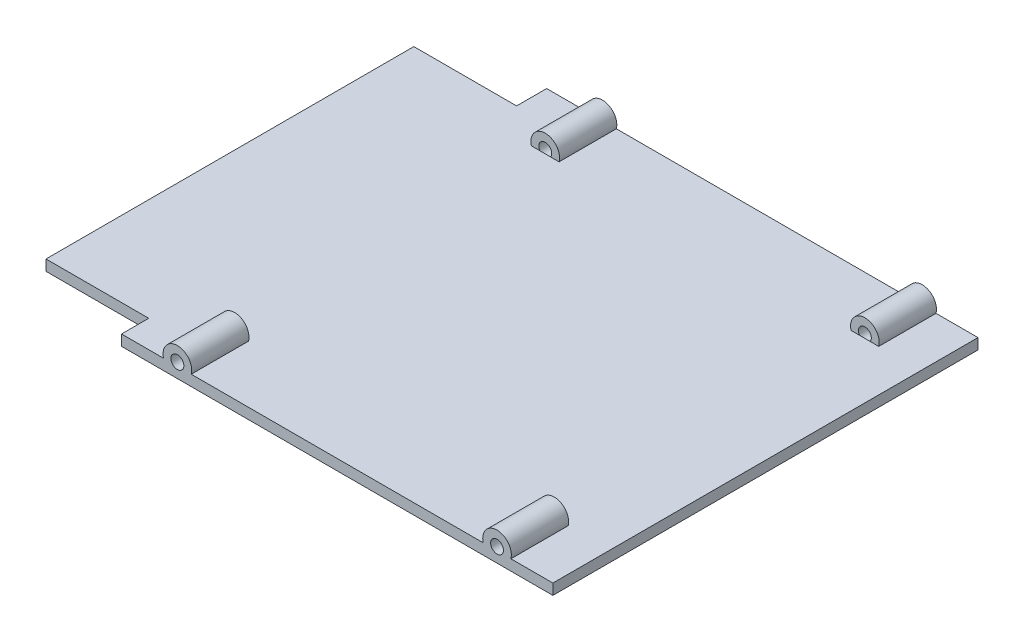
ISO-10303-21;
HEADER;
FILE_DESCRIPTION(('STEP AP214'),'2;1');
FILE_NAME('part.step','',(''),(''),'','','');
FILE_SCHEMA(('AUTOMOTIVE_DESIGN { 1 0 10303 214 1 1 1 1 }'));
ENDSEC;
DATA;
#1=APPLICATION_CONTEXT('core data for automotive mechanical design processes');
#2=APPLICATION_PROTOCOL_DEFINITION('international standard','automotive_design',2000,#1);
#3=PRODUCT_CONTEXT('',#1,'mechanical');
#4=PRODUCT('Part','Part','',(#3));
#5=PRODUCT_RELATED_PRODUCT_CATEGORY('part','',(#4));
#6=PRODUCT_DEFINITION_FORMATION('','',#4);
#7=PRODUCT_DEFINITION_CONTEXT('part definition',#1,'design');
#8=PRODUCT_DEFINITION('design','',#6,#7);
#9=PRODUCT_DEFINITION_SHAPE('','',#8);
#10=(LENGTH_UNIT() NAMED_UNIT(*) SI_UNIT(.MILLI.,.METRE.));
#11=(NAMED_UNIT(*) PLANE_ANGLE_UNIT() SI_UNIT($,.RADIAN.));
#12=(NAMED_UNIT(*) SI_UNIT($,.STERADIAN.) SOLID_ANGLE_UNIT());
#13=UNCERTAINTY_MEASURE_WITH_UNIT(LENGTH_MEASURE(1.E-05),#10,'distance_accuracy_value','');
#14=(GEOMETRIC_REPRESENTATION_CONTEXT(3) GLOBAL_UNCERTAINTY_ASSIGNED_CONTEXT((#13)) GLOBAL_UNIT_ASSIGNED_CONTEXT((#10,
#11,#12)) REPRESENTATION_CONTEXT('',''));
#15=CARTESIAN_POINT('',(0.,0.,0.));
#16=DIRECTION('',(0.,0.,1.));
#17=DIRECTION('',(1.,0.,0.));
#18=AXIS2_PLACEMENT_3D('',#15,#16,#17);
#19=CARTESIAN_POINT('',(-567.144993097305,-6.26719487480586,-74.8561140107656));
#20=DIRECTION('',(-1.,0.,0.));
#21=DIRECTION('',(0.,0.,1.));
#22=AXIS2_PLACEMENT_3D('',#19,#20,#21);
#23=PLANE('',#22);
#24=DIRECTION('',(0.,1.,0.));
#25=VECTOR('',#24,1.);
#26=CARTESIAN_POINT('',(-567.144993097307,-26.2671948748163,40.9925552959329));
#27=LINE('',#26,#25);
#28=CARTESIAN_POINT('',(-567.144993097305,-26.2671948748163,40.9925552959329));
#29=VERTEX_POINT('',#28);
#30=CARTESIAN_POINT('',(-567.144993097305,-24.7671948748163,40.9925552959329));
#31=VERTEX_POINT('',#30);
#32=EDGE_CURVE('E255',#29,#31,#27,.T.);
#33=ORIENTED_EDGE('',*,*,#32,.F.);
#34=DIRECTION('',(0.,0.,1.));
#35=VECTOR('',#34,1.);
#36=CARTESIAN_POINT('',(-567.144993097305,-26.2671948748163,-74.8561140107656));
#37=LINE('',#36,#35);
#38=CARTESIAN_POINT('',(-567.144993097305,-26.2671948748163,44.7925552959319));
#39=VERTEX_POINT('',#38);
#40=EDGE_CURVE('E308',#29,#39,#37,.T.);
#41=ORIENTED_EDGE('',*,*,#40,.T.);
#42=DIRECTION('',(0.,-1.,0.));
#43=VECTOR('',#42,1.);
#44=CARTESIAN_POINT('',(-567.144993097305,-6.26719487480586,44.7925552959319));
#45=LINE('',#44,#43);
#46=CARTESIAN_POINT('',(-567.144993097305,-24.7671948748163,44.7925552959319));
#47=VERTEX_POINT('',#46);
#48=EDGE_CURVE('E285',#47,#39,#45,.T.);
#49=ORIENTED_EDGE('',*,*,#48,.F.);
#50=DIRECTION('',(0.,0.,1.));
#51=VECTOR('',#50,1.);
#52=CARTESIAN_POINT('',(-567.144993097305,-24.7671948748163,-74.8561140107656));
#53=LINE('',#52,#51);
#54=EDGE_CURVE('E312',#31,#47,#53,.T.);
#55=ORIENTED_EDGE('',*,*,#54,.F.);
#56=EDGE_LOOP('',(#33,#41,#49,#55));
#57=FACE_BOUND('',#56,.T.);
#58=ADVANCED_FACE('F40',(#57),#23,.T.);
#59=CARTESIAN_POINT('',(-391.344993097289,-6.26719487480598,-14.5874447040671));
#60=DIRECTION('',(0.,0.,-1.));
#61=DIRECTION('',(-1.,0.,0.));
#62=AXIS2_PLACEMENT_3D('',#59,#60,#61);
#63=PLANE('',#62);
#64=CARTESIAN_POINT('',(-559.344993097226,-24.2671948748052,-14.5874447040671));
#65=DIRECTION('',(0.,0.,-1.));
#66=DIRECTION('',(0.,1.,0.));
#67=AXIS2_PLACEMENT_3D('',#64,#65,#66);
#68=CIRCLE('',#67,0.900000000010855);
#69=CARTESIAN_POINT('',(-559.344993097226,-23.3671948747944,-14.5874447040671));
#70=VERTEX_POINT('',#69);
#71=EDGE_CURVE('E213',#70,#70,#68,.T.);
#72=ORIENTED_EDGE('',*,*,#71,.F.);
#73=EDGE_LOOP('',(#72));
#74=FACE_BOUND('',#73,.T.);
#75=CARTESIAN_POINT('',(-514.694993097289,-24.2671948748052,-14.5874447040671));
#76=DIRECTION('',(0.,0.,-1.));
#77=DIRECTION('',(0.,1.,0.));
#78=AXIS2_PLACEMENT_3D('',#75,#76,#77);
#79=CIRCLE('',#78,0.900000000010855);
#80=CARTESIAN_POINT('',(-514.694993097289,-23.3671948747943,-14.5874447040671));
#81=VERTEX_POINT('',#80);
#82=EDGE_CURVE('E216',#81,#81,#79,.T.);
#83=ORIENTED_EDGE('',*,*,#82,.F.);
#84=EDGE_LOOP('',(#83));
#85=FACE_BOUND('',#84,.T.);
#86=DIRECTION('',(-1.,0.,0.));
#87=VECTOR('',#86,1.);
#88=CARTESIAN_POINT('',(-391.34499309729,-24.7671948748163,-14.5874447040671));
#89=LINE('',#88,#87);
#90=CARTESIAN_POINT('',(-561.281484769779,-24.7671948748163,-14.5874447040671));
#91=VERTEX_POINT('',#90);
#92=CARTESIAN_POINT('',(-567.144993097305,-24.7671948748163,-14.5874447040671));
#93=VERTEX_POINT('',#92);
#94=EDGE_CURVE('E314',#91,#93,#89,.T.);
#95=ORIENTED_EDGE('',*,*,#94,.F.);
#96=CARTESIAN_POINT('',(-559.344993097226,-24.2671948748052,-14.5874447040671));
#97=DIRECTION('',(0.,0.,-1.));
#98=DIRECTION('',(0.,1.,0.));
#99=AXIS2_PLACEMENT_3D('',#96,#97,#98);
#100=CIRCLE('',#99,1.99999999946984);
#101=CARTESIAN_POINT('',(-557.408501424673,-24.7671948748163,-14.5874447040671));
#102=VERTEX_POINT('',#101);
#103=EDGE_CURVE('E225',#91,#102,#100,.T.);
#104=ORIENTED_EDGE('',*,*,#103,.T.);
#105=CARTESIAN_POINT('',(-516.631484771049,-24.7671948748163,-14.5874447040671));
#106=VERTEX_POINT('',#105);
#107=EDGE_CURVE('E313',#106,#102,#89,.T.);
#108=ORIENTED_EDGE('',*,*,#107,.F.);
#109=CARTESIAN_POINT('',(-514.694993097289,-24.2671948748052,-14.5874447040671));
#110=DIRECTION('',(0.,0.,-1.));
#111=DIRECTION('',(0.,1.,0.));
#112=AXIS2_PLACEMENT_3D('',#109,#110,#111);
#113=CIRCLE('',#112,2.00000000063811);
#114=CARTESIAN_POINT('',(-512.758501423529,-24.7671948748163,-14.5874447040671));
#115=VERTEX_POINT('',#114);
#116=EDGE_CURVE('E228',#106,#115,#113,.T.);
#117=ORIENTED_EDGE('',*,*,#116,.T.);
#118=CARTESIAN_POINT('',(-506.894993097303,-24.7671948748163,-14.5874447040671));
#119=VERTEX_POINT('',#118);
#120=EDGE_CURVE('E310',#119,#115,#89,.T.);
#121=ORIENTED_EDGE('',*,*,#120,.F.);
#122=DIRECTION('',(0.,1.,0.));
#123=VECTOR('',#122,1.);
#124=CARTESIAN_POINT('',(-506.894993097303,-6.26719487480586,-14.5874447040671));
#125=LINE('',#124,#123);
#126=CARTESIAN_POINT('',(-506.894993097303,-26.2671948748163,-14.5874447040671));
#127=VERTEX_POINT('',#126);
#128=EDGE_CURVE('E288',#127,#119,#125,.T.);
#129=ORIENTED_EDGE('',*,*,#128,.F.);
#130=DIRECTION('',(1.,0.,0.));
#131=VECTOR('',#130,1.);
#132=CARTESIAN_POINT('',(-391.34499309729,-26.2671948748163,-14.5874447040671));
#133=LINE('',#132,#131);
#134=CARTESIAN_POINT('',(-567.144993097305,-26.2671948748163,-14.5874447040671));
#135=VERTEX_POINT('',#134);
#136=EDGE_CURVE('E301',#135,#127,#133,.T.);
#137=ORIENTED_EDGE('',*,*,#136,.F.);
#138=DIRECTION('',(0.,-1.,0.));
#139=VECTOR('',#138,1.);
#140=CARTESIAN_POINT('',(-567.144993097305,-6.26719487480586,-14.5874447040671));
#141=LINE('',#140,#139);
#142=EDGE_CURVE('E305',#93,#135,#141,.T.);
#143=ORIENTED_EDGE('',*,*,#142,.F.);
#144=EDGE_LOOP('',(#95,#104,#108,#117,#121,#129,#137,#143));
#145=FACE_BOUND('',#144,.T.);
#146=ADVANCED_FACE('F42',(#74,#85,#145),#63,.T.);
#147=CARTESIAN_POINT('',(0.,0.,44.7925552959312));
#148=DIRECTION('',(0.,0.,1.));
#149=DIRECTION('',(1.,0.,0.));
#150=AXIS2_PLACEMENT_3D('',#147,#148,#149);
#151=PLANE('',#150);
#152=CARTESIAN_POINT('',(-514.694993097289,-24.2671948748052,44.7925552959312));
#153=DIRECTION('',(0.,0.,1.));
#154=DIRECTION('',(1.,0.,0.));
#155=AXIS2_PLACEMENT_3D('',#152,#153,#154);
#156=CIRCLE('',#155,0.899999999982432);
#157=CARTESIAN_POINT('',(-513.794993097306,-24.2671948748052,44.7925552959312));
#158=VERTEX_POINT('',#157);
#159=EDGE_CURVE('E396',#158,#158,#156,.T.);
#160=ORIENTED_EDGE('',*,*,#159,.F.);
#161=EDGE_LOOP('',(#160));
#162=FACE_BOUND('',#161,.T.);
#163=CARTESIAN_POINT('',(-559.344993097226,-24.2671948748052,44.7925552959312));
#164=DIRECTION('',(0.,0.,1.));
#165=DIRECTION('',(1.,0.,0.));
#166=AXIS2_PLACEMENT_3D('',#163,#164,#165);
#167=CIRCLE('',#166,0.899999999982697);
#168=CARTESIAN_POINT('',(-558.444993097243,-24.2671948748052,44.7925552959312));
#169=VERTEX_POINT('',#168);
#170=EDGE_CURVE('E185',#169,#169,#167,.T.);
#171=ORIENTED_EDGE('',*,*,#170,.F.);
#172=EDGE_LOOP('',(#171));
#173=FACE_BOUND('',#172,.T.);
#174=DIRECTION('',(-1.,0.,0.));
#175=VECTOR('',#174,1.);
#176=CARTESIAN_POINT('',(-391.34499309729,-24.7671948748163,44.7925552959316));
#177=LINE('',#176,#175);
#178=CARTESIAN_POINT('',(-506.894993097303,-24.7671948748163,44.7925552959318));
#179=VERTEX_POINT('',#178);
#180=CARTESIAN_POINT('',(-512.758501424418,-24.7671948748163,44.7925552959312));
#181=VERTEX_POINT('',#180);
#182=EDGE_CURVE('E289',#179,#181,#177,.T.);
#183=ORIENTED_EDGE('',*,*,#182,.T.);
#184=CARTESIAN_POINT('',(-514.694993097289,-24.2671948748052,44.7925552959312));
#185=DIRECTION('',(0.,0.,1.));
#186=DIRECTION('',(1.,0.,0.));
#187=AXIS2_PLACEMENT_3D('',#184,#185,#186);
#188=CIRCLE('',#187,1.99999999977756);
#189=CARTESIAN_POINT('',(-516.63148477016,-24.7671948748163,44.7925552959318));
#190=VERTEX_POINT('',#189);
#191=EDGE_CURVE('E368',#181,#190,#188,.T.);
#192=ORIENTED_EDGE('',*,*,#191,.T.);
#193=CARTESIAN_POINT('',(-557.408501424106,-24.7671948748163,44.7925552959312));
#194=VERTEX_POINT('',#193);
#195=EDGE_CURVE('E292',#190,#194,#177,.T.);
#196=ORIENTED_EDGE('',*,*,#195,.T.);
#197=CARTESIAN_POINT('',(-559.344993097226,-24.2671948748052,44.7925552959312));
#198=DIRECTION('',(0.,0.,1.));
#199=DIRECTION('',(1.,0.,0.));
#200=AXIS2_PLACEMENT_3D('',#197,#198,#199);
#201=CIRCLE('',#200,2.00000000001844);
#202=CARTESIAN_POINT('',(-561.281484770346,-24.7671948748163,44.7925552959318));
#203=VERTEX_POINT('',#202);
#204=EDGE_CURVE('E366',#194,#203,#201,.T.);
#205=ORIENTED_EDGE('',*,*,#204,.T.);
#206=EDGE_CURVE('E293',#203,#47,#177,.T.);
#207=ORIENTED_EDGE('',*,*,#206,.T.);
#208=ORIENTED_EDGE('',*,*,#48,.T.);
#209=DIRECTION('',(1.,0.,0.));
#210=VECTOR('',#209,1.);
#211=CARTESIAN_POINT('',(-391.34499309729,-26.2671948748163,44.7925552959316));
#212=LINE('',#211,#210);
#213=CARTESIAN_POINT('',(-506.894993097303,-26.2671948748163,44.7925552959318));
#214=VERTEX_POINT('',#213);
#215=EDGE_CURVE('E268',#39,#214,#212,.T.);
#216=ORIENTED_EDGE('',*,*,#215,.T.);
#217=DIRECTION('',(0.,1.,0.));
#218=VECTOR('',#217,1.);
#219=CARTESIAN_POINT('',(-506.894993097303,-6.26719487480586,44.7925552959318));
#220=LINE('',#219,#218);
#221=EDGE_CURVE('E294',#214,#179,#220,.T.);
#222=ORIENTED_EDGE('',*,*,#221,.T.);
#223=EDGE_LOOP('',(#183,#192,#196,#205,#207,#208,#216,#222));
#224=FACE_BOUND('',#223,.T.);
#225=ADVANCED_FACE('F364',(#162,#173,#224),#151,.T.);
#226=CARTESIAN_POINT('',(-506.894993097303,-6.26719487480586,-74.8561140107657));
#227=DIRECTION('',(1.,0.,0.));
#228=DIRECTION('',(0.,0.,-1.));
#229=AXIS2_PLACEMENT_3D('',#226,#227,#228);
#230=PLANE('',#229);
#231=DIRECTION('',(0.,0.,1.));
#232=VECTOR('',#231,1.);
#233=CARTESIAN_POINT('',(-506.894993097303,-26.2671948748163,-74.8561140107657));
#234=LINE('',#233,#232);
#235=EDGE_CURVE('E303',#127,#214,#234,.T.);
#236=ORIENTED_EDGE('',*,*,#235,.F.);
#237=ORIENTED_EDGE('',*,*,#128,.T.);
#238=DIRECTION('',(0.,0.,1.));
#239=VECTOR('',#238,1.);
#240=CARTESIAN_POINT('',(-506.894993097303,-24.7671948748163,-74.8561140107657));
#241=LINE('',#240,#239);
#242=EDGE_CURVE('E300',#119,#179,#241,.T.);
#243=ORIENTED_EDGE('',*,*,#242,.T.);
#244=ORIENTED_EDGE('',*,*,#221,.F.);
#245=EDGE_LOOP('',(#236,#237,#243,#244));
#246=FACE_BOUND('',#245,.T.);
#247=ADVANCED_FACE('F405',(#246),#230,.T.);
#248=CARTESIAN_POINT('',(-391.34499309729,-24.7671948748163,-74.8561140107658));
#249=DIRECTION('',(0.,1.,0.));
#250=DIRECTION('',(-1.,0.,0.));
#251=AXIS2_PLACEMENT_3D('',#248,#249,#250);
#252=PLANE('',#251);
#253=DIRECTION('',(0.,0.,1.));
#254=VECTOR('',#253,1.);
#255=CARTESIAN_POINT('',(-561.281484770346,-24.7671948748163,36.7925552959312));
#256=LINE('',#255,#254);
#257=CARTESIAN_POINT('',(-561.281484770346,-24.7671948748163,36.7925552959312));
#258=VERTEX_POINT('',#257);
#259=EDGE_CURVE('E205',#258,#203,#256,.T.);
#260=ORIENTED_EDGE('',*,*,#259,.F.);
#261=DIRECTION('',(1.,0.,0.));
#262=VECTOR('',#261,1.);
#263=CARTESIAN_POINT('',(-391.34499309729,-24.7671948748163,36.7925552959312));
#264=LINE('',#263,#262);
#265=CARTESIAN_POINT('',(-560.093324574553,-24.7671948748163,36.7925552959312));
#266=VERTEX_POINT('',#265);
#267=EDGE_CURVE('E197',#258,#266,#264,.T.);
#268=ORIENTED_EDGE('',*,*,#267,.T.);
#269=CARTESIAN_POINT('',(-558.5966616199,-24.7671948748163,36.7925552959312));
#270=VERTEX_POINT('',#269);
#271=EDGE_CURVE('E184',#266,#270,#264,.T.);
#272=ORIENTED_EDGE('',*,*,#271,.T.);
#273=CARTESIAN_POINT('',(-557.408501424106,-24.7671948748163,36.7925552959312));
#274=VERTEX_POINT('',#273);
#275=EDGE_CURVE('E188',#270,#274,#264,.T.);
#276=ORIENTED_EDGE('',*,*,#275,.T.);
#277=DIRECTION('',(0.,0.,1.));
#278=VECTOR('',#277,1.);
#279=CARTESIAN_POINT('',(-557.408501424106,-24.7671948748163,36.7925552959312));
#280=LINE('',#279,#278);
#281=EDGE_CURVE('E200',#194,#274,#280,.F.);
#282=ORIENTED_EDGE('',*,*,#281,.F.);
#283=ORIENTED_EDGE('',*,*,#195,.F.);
#284=DIRECTION('',(0.,0.,1.));
#285=VECTOR('',#284,1.);
#286=CARTESIAN_POINT('',(-516.63148477016,-24.7671948748163,36.7925552959312));
#287=LINE('',#286,#285);
#288=CARTESIAN_POINT('',(-516.63148477016,-24.7671948748163,36.7925552959312));
#289=VERTEX_POINT('',#288);
#290=EDGE_CURVE('E195',#289,#190,#287,.T.);
#291=ORIENTED_EDGE('',*,*,#290,.F.);
#292=DIRECTION('',(1.,0.,0.));
#293=VECTOR('',#292,1.);
#294=CARTESIAN_POINT('',(-391.34499309729,-24.7671948748163,36.7925552959312));
#295=LINE('',#294,#293);
#296=CARTESIAN_POINT('',(-515.443324574615,-24.7671948748163,36.7925552959312));
#297=VERTEX_POINT('',#296);
#298=EDGE_CURVE('E382',#289,#297,#295,.T.);
#299=ORIENTED_EDGE('',*,*,#298,.T.);
#300=CARTESIAN_POINT('',(-513.946661619963,-24.7671948748163,36.7925552959312));
#301=VERTEX_POINT('',#300);
#302=EDGE_CURVE('E384',#297,#301,#295,.T.);
#303=ORIENTED_EDGE('',*,*,#302,.T.);
#304=CARTESIAN_POINT('',(-512.758501424418,-24.7671948748163,36.7925552959312));
#305=VERTEX_POINT('',#304);
#306=EDGE_CURVE('E375',#301,#305,#295,.T.);
#307=ORIENTED_EDGE('',*,*,#306,.T.);
#308=DIRECTION('',(0.,0.,1.));
#309=VECTOR('',#308,1.);
#310=CARTESIAN_POINT('',(-512.758501424418,-24.7671948748163,36.7925552959312));
#311=LINE('',#310,#309);
#312=EDGE_CURVE('E383',#181,#305,#311,.F.);
#313=ORIENTED_EDGE('',*,*,#312,.F.);
#314=ORIENTED_EDGE('',*,*,#182,.F.);
#315=ORIENTED_EDGE('',*,*,#242,.F.);
#316=ORIENTED_EDGE('',*,*,#120,.T.);
#317=DIRECTION('',(0.,0.,-1.));
#318=VECTOR('',#317,1.);
#319=CARTESIAN_POINT('',(-512.758501423529,-24.7671948748163,-6.58744470406709));
#320=LINE('',#319,#318);
#321=CARTESIAN_POINT('',(-512.758501423529,-24.7671948748163,-6.58744470406709));
#322=VERTEX_POINT('',#321);
#323=EDGE_CURVE('E240',#322,#115,#320,.T.);
#324=ORIENTED_EDGE('',*,*,#323,.F.);
#325=DIRECTION('',(-1.,0.,0.));
#326=VECTOR('',#325,1.);
#327=CARTESIAN_POINT('',(-391.34499309729,-24.7671948748163,-6.58744470406708));
#328=LINE('',#327,#326);
#329=CARTESIAN_POINT('',(-513.946661619928,-24.7671948748163,-6.58744470406709));
#330=VERTEX_POINT('',#329);
#331=EDGE_CURVE('E233',#322,#330,#328,.T.);
#332=ORIENTED_EDGE('',*,*,#331,.T.);
#333=CARTESIAN_POINT('',(-515.443324574649,-24.7671948748163,-6.58744470406709));
#334=VERTEX_POINT('',#333);
#335=EDGE_CURVE('E237',#330,#334,#328,.T.);
#336=ORIENTED_EDGE('',*,*,#335,.T.);
#337=CARTESIAN_POINT('',(-516.631484771049,-24.7671948748163,-6.58744470406709));
#338=VERTEX_POINT('',#337);
#339=EDGE_CURVE('E224',#334,#338,#328,.T.);
#340=ORIENTED_EDGE('',*,*,#339,.T.);
#341=DIRECTION('',(0.,0.,-1.));
#342=VECTOR('',#341,1.);
#343=CARTESIAN_POINT('',(-516.631484771049,-24.7671948748163,-6.58744470406709));
#344=LINE('',#343,#342);
#345=EDGE_CURVE('E236',#106,#338,#344,.F.);
#346=ORIENTED_EDGE('',*,*,#345,.F.);
#347=ORIENTED_EDGE('',*,*,#107,.T.);
#348=DIRECTION('',(0.,0.,-1.));
#349=VECTOR('',#348,1.);
#350=CARTESIAN_POINT('',(-557.408501424673,-24.7671948748163,-6.58744470406709));
#351=LINE('',#350,#349);
#352=CARTESIAN_POINT('',(-557.408501424673,-24.7671948748163,-6.58744470406709));
#353=VERTEX_POINT('',#352);
#354=EDGE_CURVE('E251',#353,#102,#351,.T.);
#355=ORIENTED_EDGE('',*,*,#354,.F.);
#356=DIRECTION('',(-1.,0.,0.));
#357=VECTOR('',#356,1.);
#358=CARTESIAN_POINT('',(-391.34499309729,-24.7671948748163,-6.58744470406708));
#359=LINE('',#358,#357);
#360=CARTESIAN_POINT('',(-558.596661619866,-24.7671948748163,-6.58744470406709));
#361=VERTEX_POINT('',#360);
#362=EDGE_CURVE('E244',#353,#361,#359,.T.);
#363=ORIENTED_EDGE('',*,*,#362,.T.);
#364=CARTESIAN_POINT('',(-560.093324574587,-24.7671948748163,-6.58744470406709));
#365=VERTEX_POINT('',#364);
#366=EDGE_CURVE('E248',#361,#365,#359,.T.);
#367=ORIENTED_EDGE('',*,*,#366,.T.);
#368=CARTESIAN_POINT('',(-561.281484769779,-24.7671948748163,-6.58744470406709));
#369=VERTEX_POINT('',#368);
#370=EDGE_CURVE('E243',#365,#369,#359,.T.);
#371=ORIENTED_EDGE('',*,*,#370,.T.);
#372=DIRECTION('',(0.,0.,-1.));
#373=VECTOR('',#372,1.);
#374=CARTESIAN_POINT('',(-561.281484769779,-24.7671948748163,-6.58744470406709));
#375=LINE('',#374,#373);
#376=EDGE_CURVE('E247',#91,#369,#375,.F.);
#377=ORIENTED_EDGE('',*,*,#376,.F.);
#378=ORIENTED_EDGE('',*,*,#94,.T.);
#379=CARTESIAN_POINT('',(-567.144993097305,-24.7671948748163,-10.3874447040668));
#380=VERTEX_POINT('',#379);
#381=EDGE_CURVE('E309',#93,#380,#53,.T.);
#382=ORIENTED_EDGE('',*,*,#381,.T.);
#383=DIRECTION('',(1.,0.,0.));
#384=VECTOR('',#383,1.);
#385=CARTESIAN_POINT('',(-633.096884113087,-24.7671948748114,-10.3874447040668));
#386=LINE('',#385,#384);
#387=CARTESIAN_POINT('',(-581.494993097289,-24.7671948748153,-10.3874447040668));
#388=VERTEX_POINT('',#387);
#389=EDGE_CURVE('E264',#388,#380,#386,.T.);
#390=ORIENTED_EDGE('',*,*,#389,.F.);
#391=DIRECTION('',(0.,0.,-1.));
#392=VECTOR('',#391,1.);
#393=CARTESIAN_POINT('',(-581.494993097289,-24.7671948748153,40.9925552959329));
#394=LINE('',#393,#392);
#395=CARTESIAN_POINT('',(-581.494993097289,-24.7671948748114,40.9925552959329));
#396=VERTEX_POINT('',#395);
#397=EDGE_CURVE('E272',#396,#388,#394,.T.);
#398=ORIENTED_EDGE('',*,*,#397,.F.);
#399=DIRECTION('',(1.,0.,0.));
#400=VECTOR('',#399,1.);
#401=CARTESIAN_POINT('',(-633.096884113087,-24.7671948748114,40.9925552959329));
#402=LINE('',#401,#400);
#403=EDGE_CURVE('E254',#396,#31,#402,.T.);
#404=ORIENTED_EDGE('',*,*,#403,.T.);
#405=ORIENTED_EDGE('',*,*,#54,.T.);
#406=ORIENTED_EDGE('',*,*,#206,.F.);
#407=EDGE_LOOP('',(#260,#268,#272,#276,#282,#283,#291,#299,#303,#307,#313,#314,#315,#316,#324,
#332,#336,#340,#346,#347,#355,#363,#367,#371,#377,#378,#382,#390,#398,#404,#405,#406));
#408=FACE_BOUND('',#407,.T.);
#409=ADVANCED_FACE('F199',(#408),#252,.T.);
#410=DIRECTION('',(0.,-1.,0.));
#411=VECTOR('',#410,1.);
#412=CARTESIAN_POINT('',(-567.144993097307,-24.7671948748163,-10.3874447040668));
#413=LINE('',#412,#411);
#414=CARTESIAN_POINT('',(-567.144993097307,-26.2671948748163,-10.3874447040668));
#415=VERTEX_POINT('',#414);
#416=EDGE_CURVE('E260',#380,#415,#413,.T.);
#417=ORIENTED_EDGE('',*,*,#416,.F.);
#418=ORIENTED_EDGE('',*,*,#381,.F.);
#419=ORIENTED_EDGE('',*,*,#142,.T.);
#420=EDGE_CURVE('E304',#135,#415,#37,.T.);
#421=ORIENTED_EDGE('',*,*,#420,.T.);
#422=EDGE_LOOP('',(#417,#418,#419,#421));
#423=FACE_BOUND('',#422,.T.);
#424=ADVANCED_FACE('F347',(#423),#23,.T.);
#425=CARTESIAN_POINT('',(-391.34499309729,-26.2671948748163,-74.8561140107658));
#426=DIRECTION('',(0.,-1.,0.));
#427=DIRECTION('',(0.,0.,-1.));
#428=AXIS2_PLACEMENT_3D('',#425,#426,#427);
#429=PLANE('',#428);
#430=ORIENTED_EDGE('',*,*,#235,.T.);
#431=ORIENTED_EDGE('',*,*,#215,.F.);
#432=ORIENTED_EDGE('',*,*,#40,.F.);
#433=DIRECTION('',(1.,0.,0.));
#434=VECTOR('',#433,1.);
#435=CARTESIAN_POINT('',(-633.096884113087,-26.2671948748114,40.9925552959329));
#436=LINE('',#435,#434);
#437=CARTESIAN_POINT('',(-581.494993097289,-26.2671948748152,40.9925552959329));
#438=VERTEX_POINT('',#437);
#439=EDGE_CURVE('E259',#438,#29,#436,.T.);
#440=ORIENTED_EDGE('',*,*,#439,.F.);
#441=DIRECTION('',(0.,0.,1.));
#442=VECTOR('',#441,1.);
#443=CARTESIAN_POINT('',(-581.494993097289,-26.2671948748153,-10.3874447040668));
#444=LINE('',#443,#442);
#445=CARTESIAN_POINT('',(-581.494993097289,-26.2671948748153,-10.3874447040668));
#446=VERTEX_POINT('',#445);
#447=EDGE_CURVE('E265',#446,#438,#444,.T.);
#448=ORIENTED_EDGE('',*,*,#447,.F.);
#449=DIRECTION('',(1.,0.,0.));
#450=VECTOR('',#449,1.);
#451=CARTESIAN_POINT('',(-633.096884113087,-26.2671948748114,-10.3874447040668));
#452=LINE('',#451,#450);
#453=EDGE_CURVE('E263',#446,#415,#452,.T.);
#454=ORIENTED_EDGE('',*,*,#453,.T.);
#455=ORIENTED_EDGE('',*,*,#420,.F.);
#456=ORIENTED_EDGE('',*,*,#136,.T.);
#457=EDGE_LOOP('',(#430,#431,#432,#440,#448,#454,#455,#456));
#458=FACE_BOUND('',#457,.T.);
#459=ADVANCED_FACE('F425',(#458),#429,.T.);
#460=CARTESIAN_POINT('',(-633.096884113087,-24.7671948748114,-10.3874447040668));
#461=DIRECTION('',(0.,0.,1.));
#462=DIRECTION('',(1.,0.,0.));
#463=AXIS2_PLACEMENT_3D('',#460,#461,#462);
#464=PLANE('',#463);
#465=DIRECTION('',(0.,-1.,0.));
#466=VECTOR('',#465,1.);
#467=CARTESIAN_POINT('',(-581.494993097289,-24.7671948748114,-10.3874447040668));
#468=LINE('',#467,#466);
#469=EDGE_CURVE('E269',#388,#446,#468,.T.);
#470=ORIENTED_EDGE('',*,*,#469,.F.);
#471=ORIENTED_EDGE('',*,*,#389,.T.);
#472=ORIENTED_EDGE('',*,*,#416,.T.);
#473=ORIENTED_EDGE('',*,*,#453,.F.);
#474=EDGE_LOOP('',(#470,#471,#472,#473));
#475=FACE_BOUND('',#474,.T.);
#476=ADVANCED_FACE('F350',(#475),#464,.F.);
#477=CARTESIAN_POINT('',(-633.096884113087,-26.2671948748114,40.9925552959329));
#478=DIRECTION('',(0.,0.,-1.));
#479=DIRECTION('',(-1.,0.,0.));
#480=AXIS2_PLACEMENT_3D('',#477,#478,#479);
#481=PLANE('',#480);
#482=DIRECTION('',(0.,1.,0.));
#483=VECTOR('',#482,1.);
#484=CARTESIAN_POINT('',(-581.494993097289,-26.2671948748114,40.9925552959329));
#485=LINE('',#484,#483);
#486=EDGE_CURVE('E258',#438,#396,#485,.T.);
#487=ORIENTED_EDGE('',*,*,#486,.F.);
#488=ORIENTED_EDGE('',*,*,#439,.T.);
#489=ORIENTED_EDGE('',*,*,#32,.T.);
#490=ORIENTED_EDGE('',*,*,#403,.F.);
#491=EDGE_LOOP('',(#487,#488,#489,#490));
#492=FACE_BOUND('',#491,.T.);
#493=ADVANCED_FACE('F356',(#492),#481,.F.);
#494=CARTESIAN_POINT('',(-581.494993097289,-23.2671948747867,61.6318694149806));
#495=DIRECTION('',(-1.,0.,0.));
#496=DIRECTION('',(0.,0.,1.));
#497=AXIS2_PLACEMENT_3D('',#494,#495,#496);
#498=PLANE('',#497);
#499=ORIENTED_EDGE('',*,*,#486,.T.);
#500=ORIENTED_EDGE('',*,*,#397,.T.);
#501=ORIENTED_EDGE('',*,*,#469,.T.);
#502=ORIENTED_EDGE('',*,*,#447,.T.);
#503=EDGE_LOOP('',(#499,#500,#501,#502));
#504=FACE_BOUND('',#503,.T.);
#505=ADVANCED_FACE('F353',(#504),#498,.T.);
#506=CARTESIAN_POINT('',(-514.694993097289,-24.2671948748052,-6.58744470406709));
#507=DIRECTION('',(0.,0.,-1.));
#508=DIRECTION('',(0.,1.,0.));
#509=AXIS2_PLACEMENT_3D('',#506,#507,#508);
#510=CYLINDRICAL_SURFACE('',#509,2.00000000063811);
#511=CARTESIAN_POINT('',(-514.694993097289,-24.2671948748052,-6.58744470406709));
#512=DIRECTION('',(0.,0.,-1.));
#513=DIRECTION('',(0.,1.,0.));
#514=AXIS2_PLACEMENT_3D('',#511,#512,#513);
#515=CIRCLE('',#514,2.00000000063811);
#516=EDGE_CURVE('E212',#338,#322,#515,.T.);
#517=ORIENTED_EDGE('',*,*,#516,.T.);
#518=ORIENTED_EDGE('',*,*,#323,.T.);
#519=ORIENTED_EDGE('',*,*,#116,.F.);
#520=ORIENTED_EDGE('',*,*,#345,.T.);
#521=EDGE_LOOP('',(#517,#518,#519,#520));
#522=FACE_BOUND('',#521,.T.);
#523=ADVANCED_FACE('F336',(#522),#510,.T.);
#524=CARTESIAN_POINT('',(-514.694993097289,-24.2671948748052,-6.58744470406709));
#525=DIRECTION('',(0.,0.,-1.));
#526=DIRECTION('',(0.,1.,0.));
#527=AXIS2_PLACEMENT_3D('',#524,#525,#526);
#528=PLANE('',#527);
#529=ORIENTED_EDGE('',*,*,#339,.F.);
#530=CARTESIAN_POINT('',(-514.694993097289,-24.2671948748052,-6.58744470406709));
#531=DIRECTION('',(0.,0.,-1.));
#532=DIRECTION('',(0.,1.,0.));
#533=AXIS2_PLACEMENT_3D('',#530,#531,#532);
#534=CIRCLE('',#533,0.900000000010855);
#535=EDGE_CURVE('E180',#334,#330,#534,.T.);
#536=ORIENTED_EDGE('',*,*,#535,.T.);
#537=ORIENTED_EDGE('',*,*,#331,.F.);
#538=ORIENTED_EDGE('',*,*,#516,.F.);
#539=EDGE_LOOP('',(#529,#536,#537,#538));
#540=FACE_BOUND('',#539,.T.);
#541=ADVANCED_FACE('F328',(#540),#528,.F.);
#542=CARTESIAN_POINT('',(-559.344993097226,-24.2671948748052,-6.58744470406709));
#543=DIRECTION('',(0.,0.,-1.));
#544=DIRECTION('',(0.,1.,0.));
#545=AXIS2_PLACEMENT_3D('',#542,#543,#544);
#546=CYLINDRICAL_SURFACE('',#545,1.99999999946984);
#547=CARTESIAN_POINT('',(-559.344993097226,-24.2671948748052,-6.58744470406709));
#548=DIRECTION('',(0.,0.,-1.));
#549=DIRECTION('',(0.,1.,0.));
#550=AXIS2_PLACEMENT_3D('',#547,#548,#549);
#551=CIRCLE('',#550,1.99999999946984);
#552=EDGE_CURVE('E221',#369,#353,#551,.T.);
#553=ORIENTED_EDGE('',*,*,#552,.T.);
#554=ORIENTED_EDGE('',*,*,#354,.T.);
#555=ORIENTED_EDGE('',*,*,#103,.F.);
#556=ORIENTED_EDGE('',*,*,#376,.T.);
#557=EDGE_LOOP('',(#553,#554,#555,#556));
#558=FACE_BOUND('',#557,.T.);
#559=ADVANCED_FACE('F542',(#558),#546,.T.);
#560=CARTESIAN_POINT('',(-559.344993097226,-24.2671948748052,-6.58744470406709));
#561=DIRECTION('',(0.,0.,-1.));
#562=DIRECTION('',(0.,1.,0.));
#563=AXIS2_PLACEMENT_3D('',#560,#561,#562);
#564=PLANE('',#563);
#565=ORIENTED_EDGE('',*,*,#370,.F.);
#566=CARTESIAN_POINT('',(-559.344993097226,-24.2671948748052,-6.58744470406709));
#567=DIRECTION('',(0.,0.,-1.));
#568=DIRECTION('',(0.,1.,0.));
#569=AXIS2_PLACEMENT_3D('',#566,#567,#568);
#570=CIRCLE('',#569,0.900000000010855);
#571=EDGE_CURVE('E321',#365,#361,#570,.T.);
#572=ORIENTED_EDGE('',*,*,#571,.T.);
#573=ORIENTED_EDGE('',*,*,#362,.F.);
#574=ORIENTED_EDGE('',*,*,#552,.F.);
#575=EDGE_LOOP('',(#565,#572,#573,#574));
#576=FACE_BOUND('',#575,.T.);
#577=ADVANCED_FACE('F533',(#576),#564,.F.);
#578=CARTESIAN_POINT('',(-559.344993097226,-24.2671948748052,-6.58744470406709));
#579=DIRECTION('',(0.,0.,-1.));
#580=DIRECTION('',(0.,1.,0.));
#581=AXIS2_PLACEMENT_3D('',#578,#579,#580);
#582=CYLINDRICAL_SURFACE('',#581,0.900000000010855);
#583=CARTESIAN_POINT('',(-559.344993097226,-24.2671948748052,-6.58744470406709));
#584=DIRECTION('',(0.,0.,-1.));
#585=DIRECTION('',(0.,1.,0.));
#586=AXIS2_PLACEMENT_3D('',#583,#584,#585);
#587=CIRCLE('',#586,0.900000000010855);
#588=EDGE_CURVE('E209',#361,#365,#587,.T.);
#589=ORIENTED_EDGE('',*,*,#588,.F.);
#590=ORIENTED_EDGE('',*,*,#571,.F.);
#591=EDGE_LOOP('',(#589,#590));
#592=FACE_BOUND('',#591,.T.);
#593=ORIENTED_EDGE('',*,*,#71,.T.);
#594=EDGE_LOOP('',(#593));
#595=FACE_BOUND('',#594,.T.);
#596=ADVANCED_FACE('F524',(#592,#595),#582,.F.);
#597=CARTESIAN_POINT('',(-559.344993097226,-24.2671948748052,-6.58744470406709));
#598=DIRECTION('',(0.,0.,-1.));
#599=DIRECTION('',(0.,1.,0.));
#600=AXIS2_PLACEMENT_3D('',#597,#598,#599);
#601=PLANE('',#600);
#602=ORIENTED_EDGE('',*,*,#588,.T.);
#603=ORIENTED_EDGE('',*,*,#366,.F.);
#604=EDGE_LOOP('',(#602,#603));
#605=FACE_BOUND('',#604,.T.);
#606=ADVANCED_FACE('F516',(#605),#601,.T.);
#607=CARTESIAN_POINT('',(-514.694993097289,-24.2671948748052,-6.58744470406709));
#608=DIRECTION('',(0.,0.,-1.));
#609=DIRECTION('',(0.,1.,0.));
#610=AXIS2_PLACEMENT_3D('',#607,#608,#609);
#611=CYLINDRICAL_SURFACE('',#610,0.900000000010855);
#612=CARTESIAN_POINT('',(-514.694993097289,-24.2671948748052,-6.58744470406709));
#613=DIRECTION('',(0.,0.,-1.));
#614=DIRECTION('',(0.,1.,0.));
#615=AXIS2_PLACEMENT_3D('',#612,#613,#614);
#616=CIRCLE('',#615,0.900000000010855);
#617=EDGE_CURVE('E208',#330,#334,#616,.T.);
#618=ORIENTED_EDGE('',*,*,#617,.F.);
#619=ORIENTED_EDGE('',*,*,#535,.F.);
#620=EDGE_LOOP('',(#618,#619));
#621=FACE_BOUND('',#620,.T.);
#622=ORIENTED_EDGE('',*,*,#82,.T.);
#623=EDGE_LOOP('',(#622));
#624=FACE_BOUND('',#623,.T.);
#625=ADVANCED_FACE('F506',(#621,#624),#611,.F.);
#626=CARTESIAN_POINT('',(-514.694993097289,-24.2671948748052,-6.58744470406709));
#627=DIRECTION('',(0.,0.,-1.));
#628=DIRECTION('',(0.,1.,0.));
#629=AXIS2_PLACEMENT_3D('',#626,#627,#628);
#630=PLANE('',#629);
#631=ORIENTED_EDGE('',*,*,#617,.T.);
#632=ORIENTED_EDGE('',*,*,#335,.F.);
#633=EDGE_LOOP('',(#631,#632));
#634=FACE_BOUND('',#633,.T.);
#635=ADVANCED_FACE('F498',(#634),#630,.T.);
#636=CARTESIAN_POINT('',(-514.694993097289,-24.2671948748052,36.7925552959312));
#637=DIRECTION('',(0.,0.,1.));
#638=DIRECTION('',(1.,0.,0.));
#639=AXIS2_PLACEMENT_3D('',#636,#637,#638);
#640=CYLINDRICAL_SURFACE('',#639,1.99999999977756);
#641=CARTESIAN_POINT('',(-514.694993097289,-24.2671948748052,36.7925552959312));
#642=DIRECTION('',(0.,0.,1.));
#643=DIRECTION('',(1.,0.,0.));
#644=AXIS2_PLACEMENT_3D('',#641,#642,#643);
#645=CIRCLE('',#644,1.99999999977756);
#646=EDGE_CURVE('E377',#305,#289,#645,.T.);
#647=ORIENTED_EDGE('',*,*,#646,.T.);
#648=ORIENTED_EDGE('',*,*,#290,.T.);
#649=ORIENTED_EDGE('',*,*,#191,.F.);
#650=ORIENTED_EDGE('',*,*,#312,.T.);
#651=EDGE_LOOP('',(#647,#648,#649,#650));
#652=FACE_BOUND('',#651,.T.);
#653=ADVANCED_FACE('F389',(#652),#640,.T.);
#654=CARTESIAN_POINT('',(-514.694993097289,-24.2671948748052,36.7925552959312));
#655=DIRECTION('',(0.,0.,1.));
#656=DIRECTION('',(1.,0.,0.));
#657=AXIS2_PLACEMENT_3D('',#654,#655,#656);
#658=PLANE('',#657);
#659=ORIENTED_EDGE('',*,*,#306,.F.);
#660=CARTESIAN_POINT('',(-514.694993097289,-24.2671948748052,36.7925552959312));
#661=DIRECTION('',(0.,0.,1.));
#662=DIRECTION('',(1.,0.,0.));
#663=AXIS2_PLACEMENT_3D('',#660,#661,#662);
#664=CIRCLE('',#663,0.899999999982432);
#665=EDGE_CURVE('E12',#301,#297,#664,.T.);
#666=ORIENTED_EDGE('',*,*,#665,.T.);
#667=ORIENTED_EDGE('',*,*,#298,.F.);
#668=ORIENTED_EDGE('',*,*,#646,.F.);
#669=EDGE_LOOP('',(#659,#666,#667,#668));
#670=FACE_BOUND('',#669,.T.);
#671=ADVANCED_FACE('F392',(#670),#658,.F.);
#672=CARTESIAN_POINT('',(-559.344993097226,-24.2671948748052,36.7925552959312));
#673=DIRECTION('',(0.,0.,1.));
#674=DIRECTION('',(1.,0.,0.));
#675=AXIS2_PLACEMENT_3D('',#672,#673,#674);
#676=CYLINDRICAL_SURFACE('',#675,2.00000000001844);
#677=CARTESIAN_POINT('',(-559.344993097226,-24.2671948748052,36.7925552959312));
#678=DIRECTION('',(0.,0.,1.));
#679=DIRECTION('',(1.,0.,0.));
#680=AXIS2_PLACEMENT_3D('',#677,#678,#679);
#681=CIRCLE('',#680,2.00000000001844);
#682=EDGE_CURVE('E191',#274,#258,#681,.T.);
#683=ORIENTED_EDGE('',*,*,#682,.T.);
#684=ORIENTED_EDGE('',*,*,#259,.T.);
#685=ORIENTED_EDGE('',*,*,#204,.F.);
#686=ORIENTED_EDGE('',*,*,#281,.T.);
#687=EDGE_LOOP('',(#683,#684,#685,#686));
#688=FACE_BOUND('',#687,.T.);
#689=ADVANCED_FACE('F373',(#688),#676,.T.);
#690=CARTESIAN_POINT('',(-559.344993097226,-24.2671948748052,36.7925552959312));
#691=DIRECTION('',(0.,0.,1.));
#692=DIRECTION('',(1.,0.,0.));
#693=AXIS2_PLACEMENT_3D('',#690,#691,#692);
#694=PLANE('',#693);
#695=ORIENTED_EDGE('',*,*,#275,.F.);
#696=CARTESIAN_POINT('',(-559.344993097226,-24.2671948748052,36.7925552959312));
#697=DIRECTION('',(0.,0.,1.));
#698=DIRECTION('',(1.,0.,0.));
#699=AXIS2_PLACEMENT_3D('',#696,#697,#698);
#700=CIRCLE('',#699,0.899999999982697);
#701=EDGE_CURVE('E48',#270,#266,#700,.T.);
#702=ORIENTED_EDGE('',*,*,#701,.T.);
#703=ORIENTED_EDGE('',*,*,#267,.F.);
#704=ORIENTED_EDGE('',*,*,#682,.F.);
#705=EDGE_LOOP('',(#695,#702,#703,#704));
#706=FACE_BOUND('',#705,.T.);
#707=ADVANCED_FACE('F189',(#706),#694,.F.);
#708=CARTESIAN_POINT('',(-559.344993097226,-24.2671948748052,36.7925552959312));
#709=DIRECTION('',(0.,0.,1.));
#710=DIRECTION('',(1.,0.,0.));
#711=AXIS2_PLACEMENT_3D('',#708,#709,#710);
#712=CYLINDRICAL_SURFACE('',#711,0.899999999982697);
#713=CARTESIAN_POINT('',(-559.344993097226,-24.2671948748052,36.7925552959312));
#714=DIRECTION('',(0.,0.,1.));
#715=DIRECTION('',(1.,0.,0.));
#716=AXIS2_PLACEMENT_3D('',#713,#714,#715);
#717=CIRCLE('',#716,0.899999999982697);
#718=EDGE_CURVE('E61',#266,#270,#717,.T.);
#719=ORIENTED_EDGE('',*,*,#718,.F.);
#720=ORIENTED_EDGE('',*,*,#701,.F.);
#721=EDGE_LOOP('',(#719,#720));
#722=FACE_BOUND('',#721,.T.);
#723=ORIENTED_EDGE('',*,*,#170,.T.);
#724=EDGE_LOOP('',(#723));
#725=FACE_BOUND('',#724,.T.);
#726=ADVANCED_FACE('F175',(#722,#725),#712,.F.);
#727=CARTESIAN_POINT('',(-559.344993097226,-24.2671948748052,36.7925552959312));
#728=DIRECTION('',(0.,0.,1.));
#729=DIRECTION('',(1.,0.,0.));
#730=AXIS2_PLACEMENT_3D('',#727,#728,#729);
#731=PLANE('',#730);
#732=ORIENTED_EDGE('',*,*,#718,.T.);
#733=ORIENTED_EDGE('',*,*,#271,.F.);
#734=EDGE_LOOP('',(#732,#733));
#735=FACE_BOUND('',#734,.T.);
#736=ADVANCED_FACE('F182',(#735),#731,.T.);
#737=CARTESIAN_POINT('',(-514.694993097289,-24.2671948748052,36.7925552959312));
#738=DIRECTION('',(0.,0.,1.));
#739=DIRECTION('',(1.,0.,0.));
#740=AXIS2_PLACEMENT_3D('',#737,#738,#739);
#741=CYLINDRICAL_SURFACE('',#740,0.899999999982432);
#742=CARTESIAN_POINT('',(-514.694993097289,-24.2671948748052,36.7925552959312));
#743=DIRECTION('',(0.,0.,1.));
#744=DIRECTION('',(1.,0.,0.));
#745=AXIS2_PLACEMENT_3D('',#742,#743,#744);
#746=CIRCLE('',#745,0.899999999982432);
#747=EDGE_CURVE('E54',#297,#301,#746,.T.);
#748=ORIENTED_EDGE('',*,*,#747,.F.);
#749=ORIENTED_EDGE('',*,*,#665,.F.);
#750=EDGE_LOOP('',(#748,#749));
#751=FACE_BOUND('',#750,.T.);
#752=ORIENTED_EDGE('',*,*,#159,.T.);
#753=EDGE_LOOP('',(#752));
#754=FACE_BOUND('',#753,.T.);
#755=ADVANCED_FACE('F465',(#751,#754),#741,.F.);
#756=CARTESIAN_POINT('',(-514.694993097289,-24.2671948748052,36.7925552959312));
#757=DIRECTION('',(0.,0.,1.));
#758=DIRECTION('',(1.,0.,0.));
#759=AXIS2_PLACEMENT_3D('',#756,#757,#758);
#760=PLANE('',#759);
#761=ORIENTED_EDGE('',*,*,#747,.T.);
#762=ORIENTED_EDGE('',*,*,#302,.F.);
#763=EDGE_LOOP('',(#761,#762));
#764=FACE_BOUND('',#763,.T.);
#765=ADVANCED_FACE('F395',(#764),#760,.T.);
#766=CLOSED_SHELL('',(#58,#146,#225,#247,#409,#424,#459,#476,#493,#505,#523,#541,#559,#577,#596,
#606,#625,#635,#653,#671,#689,#707,#726,#736,#755,#765));
#767=MANIFOLD_SOLID_BREP('B2',#766);
#768=ADVANCED_BREP_SHAPE_REPRESENTATION('',(#18,#767),#14);
#769=SHAPE_DEFINITION_REPRESENTATION(#9,#768);
ENDSEC;
END-ISO-10303-21;
